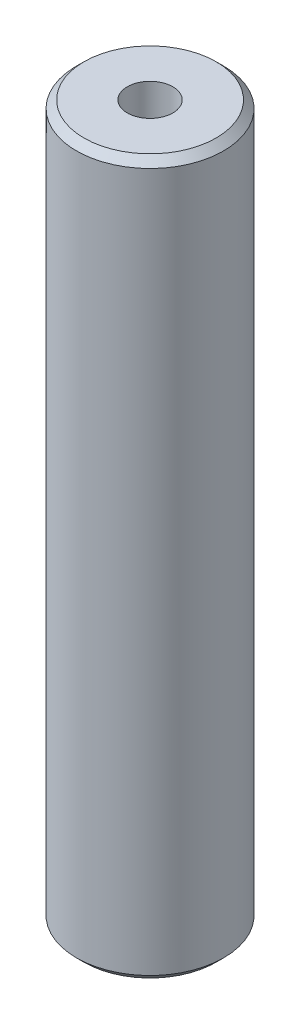
ISO-10303-21;
HEADER;
FILE_DESCRIPTION(('STEP AP214'),'2;1');
FILE_NAME('part.step','',(''),(''),'','','');
FILE_SCHEMA(('AUTOMOTIVE_DESIGN { 1 0 10303 214 1 1 1 1 }'));
ENDSEC;
DATA;
#1=APPLICATION_CONTEXT('core data for automotive mechanical design processes');
#2=APPLICATION_PROTOCOL_DEFINITION('international standard','automotive_design',2000,#1);
#3=PRODUCT_CONTEXT('',#1,'mechanical');
#4=PRODUCT('Part','Part','',(#3));
#5=PRODUCT_RELATED_PRODUCT_CATEGORY('part','',(#4));
#6=PRODUCT_DEFINITION_FORMATION('','',#4);
#7=PRODUCT_DEFINITION_CONTEXT('part definition',#1,'design');
#8=PRODUCT_DEFINITION('design','',#6,#7);
#9=PRODUCT_DEFINITION_SHAPE('','',#8);
#10=(LENGTH_UNIT() NAMED_UNIT(*) SI_UNIT(.MILLI.,.METRE.));
#11=(NAMED_UNIT(*) PLANE_ANGLE_UNIT() SI_UNIT($,.RADIAN.));
#12=(NAMED_UNIT(*) SI_UNIT($,.STERADIAN.) SOLID_ANGLE_UNIT());
#13=UNCERTAINTY_MEASURE_WITH_UNIT(LENGTH_MEASURE(1.E-05),#10,'distance_accuracy_value','');
#14=(GEOMETRIC_REPRESENTATION_CONTEXT(3) GLOBAL_UNCERTAINTY_ASSIGNED_CONTEXT((#13)) GLOBAL_UNIT_ASSIGNED_CONTEXT((#10,
#11,#12)) REPRESENTATION_CONTEXT('',''));
#15=CARTESIAN_POINT('',(0.,0.,0.));
#16=DIRECTION('',(0.,0.,1.));
#17=DIRECTION('',(1.,0.,0.));
#18=AXIS2_PLACEMENT_3D('',#15,#16,#17);
#19=CARTESIAN_POINT('',(0.,412.433679047202,0.));
#20=DIRECTION('',(0.,-1.,0.));
#21=DIRECTION('',(0.,0.,-1.));
#22=AXIS2_PLACEMENT_3D('',#19,#20,#21);
#23=CYLINDRICAL_SURFACE('',#22,42.5);
#24=CARTESIAN_POINT('',(0.,408.121310022054,0.));
#25=DIRECTION('',(0.,1.,0.));
#26=DIRECTION('',(0.,0.,1.));
#27=AXIS2_PLACEMENT_3D('',#24,#25,#26);
#28=CIRCLE('',#27,42.5);
#29=CARTESIAN_POINT('',(0.,408.121310022054,-42.5));
#30=VERTEX_POINT('',#29);
#31=EDGE_CURVE('E50',#30,#30,#28,.F.);
#32=CARTESIAN_POINT('',(0.,4.31236902514853,0.));
#33=DIRECTION('',(0.,1.,0.));
#34=DIRECTION('',(0.,0.,1.));
#35=AXIS2_PLACEMENT_3D('',#32,#33,#34);
#36=CIRCLE('',#35,42.5);
#37=CARTESIAN_POINT('',(0.,4.31236902514853,-42.5));
#38=VERTEX_POINT('',#37);
#39=EDGE_CURVE('E51',#38,#38,#36,.T.);
#40=CARTESIAN_POINT('',(0.,408.121310022054,-42.5));
#41=CARTESIAN_POINT('',(0.,403.914966886669,-42.5));
#42=CARTESIAN_POINT('',(0.,399.708623751285,-42.5));
#43=CARTESIAN_POINT('',(0.,391.295937480516,-42.5));
#44=CARTESIAN_POINT('',(0.,387.089594345132,-42.5));
#45=CARTESIAN_POINT('',(0.,378.676908074363,-42.5));
#46=CARTESIAN_POINT('',(0.,374.470564938978,-42.5));
#47=CARTESIAN_POINT('',(0.,366.057878668209,-42.5));
#48=CARTESIAN_POINT('',(0.,361.851535532825,-42.5));
#49=CARTESIAN_POINT('',(0.,353.438849262056,-42.5));
#50=CARTESIAN_POINT('',(0.,349.232506126672,-42.5));
#51=CARTESIAN_POINT('',(0.,340.819819855903,-42.5));
#52=CARTESIAN_POINT('',(0.,336.613476720518,-42.5));
#53=CARTESIAN_POINT('',(0.,328.20079044975,-42.5));
#54=CARTESIAN_POINT('',(0.,323.994447314365,-42.5));
#55=CARTESIAN_POINT('',(0.,315.581761043596,-42.5));
#56=CARTESIAN_POINT('',(0.,311.375417908212,-42.5));
#57=CARTESIAN_POINT('',(0.,302.962731637443,-42.5));
#58=CARTESIAN_POINT('',(0.,298.756388502059,-42.5));
#59=CARTESIAN_POINT('',(0.,290.34370223129,-42.5));
#60=CARTESIAN_POINT('',(0.,286.137359095905,-42.5));
#61=CARTESIAN_POINT('',(0.,277.724672825136,-42.5));
#62=CARTESIAN_POINT('',(0.,273.518329689752,-42.5));
#63=CARTESIAN_POINT('',(0.,265.105643418983,-42.5));
#64=CARTESIAN_POINT('',(0.,260.899300283599,-42.5));
#65=CARTESIAN_POINT('',(0.,252.48661401283,-42.5));
#66=CARTESIAN_POINT('',(0.,248.280270877445,-42.5));
#67=CARTESIAN_POINT('',(0.,239.867584606677,-42.5));
#68=CARTESIAN_POINT('',(0.,235.661241471292,-42.5));
#69=CARTESIAN_POINT('',(0.,227.248555200523,-42.5));
#70=CARTESIAN_POINT('',(0.,223.042212065139,-42.5));
#71=CARTESIAN_POINT('',(0.,214.62952579437,-42.5));
#72=CARTESIAN_POINT('',(0.,210.423182658986,-42.5));
#73=CARTESIAN_POINT('',(0.,202.010496388217,-42.5));
#74=CARTESIAN_POINT('',(0.,197.804153252832,-42.5));
#75=CARTESIAN_POINT('',(0.,189.391466982063,-42.5));
#76=CARTESIAN_POINT('',(0.,185.185123846679,-42.5));
#77=CARTESIAN_POINT('',(0.,176.77243757591,-42.5));
#78=CARTESIAN_POINT('',(0.,172.566094440526,-42.5));
#79=CARTESIAN_POINT('',(0.,164.153408169757,-42.5));
#80=CARTESIAN_POINT('',(0.,159.947065034372,-42.5));
#81=CARTESIAN_POINT('',(0.,151.534378763604,-42.5));
#82=CARTESIAN_POINT('',(0.,147.328035628219,-42.5));
#83=CARTESIAN_POINT('',(0.,138.91534935745,-42.5));
#84=CARTESIAN_POINT('',(0.,134.709006222066,-42.5));
#85=CARTESIAN_POINT('',(0.,126.296319951297,-42.5));
#86=CARTESIAN_POINT('',(0.,122.089976815913,-42.5));
#87=CARTESIAN_POINT('',(0.,113.677290545144,-42.5));
#88=CARTESIAN_POINT('',(0.,109.470947409759,-42.5));
#89=CARTESIAN_POINT('',(0.,101.05826113899,-42.5));
#90=CARTESIAN_POINT('',(0.,96.851918003606,-42.5));
#91=CARTESIAN_POINT('',(0.,88.4392317328371,-42.5));
#92=CARTESIAN_POINT('',(0.,84.2328885974527,-42.5));
#93=CARTESIAN_POINT('',(0.,75.8202023266839,-42.5));
#94=CARTESIAN_POINT('',(0.,71.6138591912994,-42.5));
#95=CARTESIAN_POINT('',(0.,63.2011729205306,-42.5));
#96=CARTESIAN_POINT('',(0.,58.9948297851461,-42.5));
#97=CARTESIAN_POINT('',(0.,50.5821435143772,-42.5));
#98=CARTESIAN_POINT('',(0.,46.3758003789928,-42.5));
#99=CARTESIAN_POINT('',(0.,37.9631141082239,-42.5));
#100=CARTESIAN_POINT('',(0.,33.7567709728395,-42.5));
#101=CARTESIAN_POINT('',(0.,25.3440847020707,-42.5));
#102=CARTESIAN_POINT('',(0.,21.1377415666862,-42.5));
#103=CARTESIAN_POINT('',(0.,12.7250552959174,-42.5));
#104=CARTESIAN_POINT('',(0.,8.51871216053296,-42.5));
#105=CARTESIAN_POINT('',(0.,4.31236902514853,-42.5));
#106=B_SPLINE_CURVE_WITH_KNOTS('',3,(#40,#41,#42,#43,#44,#45,#46,#47,#48,#49,#50,#51,#52,#53,
#54,#55,#56,#57,#58,#59,#60,#61,#62,#63,#64,#65,#66,#67,#68,#69,#70,#71,#72,#73,#74,#75,#76,#77,
#78,#79,#80,#81,#82,#83,#84,#85,#86,#87,#88,#89,#90,#91,#92,#93,#94,#95,#96,#97,#98,#99,#100,
#101,#102,#103,#104,#105),.UNSPECIFIED.,.F.,.F.,(4,2,2,2,2,2,2,2,2,2,2,2,2,2,2,2,2,2,2,2,2,2,2,
2,2,2,2,2,2,2,2,2,4),(0.,12.6190294061533,25.2380588123066,37.8570882184598,50.4761176246131,
63.0951470307664,75.7141764369197,88.333205843073,100.952235249226,113.57126465538,
126.190294061533,138.809323467686,151.428352873839,164.047382279993,176.666411686146,
189.285441092299,201.904470498453,214.523499904606,227.142529310759,239.761558716912,
252.380588123066,264.999617529219,277.618646935372,290.237676341526,302.856705747679,
315.475735153832,328.094764559985,340.713793966139,353.332823372292,365.951852778445,
378.570882184599,391.189911590752,403.808940996905),.UNSPECIFIED.);
#107=EDGE_CURVE('BSEAM39',#30,#38,#106,.T.);
#108=ORIENTED_EDGE('',*,*,#31,.T.);
#109=ORIENTED_EDGE('',*,*,#39,.T.);
#110=ORIENTED_EDGE('',*,*,#107,.T.);
#111=ORIENTED_EDGE('',*,*,#107,.F.);
#112=EDGE_LOOP('',(#108,#110,#109,#111));
#113=FACE_BOUND('',#112,.T.);
#114=ADVANCED_FACE('F39',(#113),#23,.T.);
#115=CARTESIAN_POINT('',(0.,412.433679047202,0.));
#116=DIRECTION('',(0.,1.,0.));
#117=DIRECTION('',(0.,0.,1.));
#118=AXIS2_PLACEMENT_3D('',#115,#116,#117);
#119=PLANE('',#118);
#120=CARTESIAN_POINT('',(0.,412.433679047202,0.));
#121=DIRECTION('',(0.,1.,0.));
#122=DIRECTION('',(0.,0.,1.));
#123=AXIS2_PLACEMENT_3D('',#120,#121,#122);
#124=CIRCLE('',#123,38.1876309748521);
#125=CARTESIAN_POINT('',(0.,412.433679047202,38.1876309748521));
#126=VERTEX_POINT('',#125);
#127=EDGE_CURVE('E54',#126,#126,#124,.T.);
#128=ORIENTED_EDGE('',*,*,#127,.T.);
#129=EDGE_LOOP('',(#128));
#130=FACE_BOUND('',#129,.T.);
#131=CARTESIAN_POINT('',(0.,412.433679047202,0.));
#132=DIRECTION('',(0.,1.,0.));
#133=DIRECTION('',(0.,0.,1.));
#134=AXIS2_PLACEMENT_3D('',#131,#132,#133);
#135=CIRCLE('',#134,13.1412385175297);
#136=CARTESIAN_POINT('',(0.,412.433679047202,-13.1412385175297));
#137=VERTEX_POINT('',#136);
#138=EDGE_CURVE('E58',#137,#137,#135,.T.);
#139=ORIENTED_EDGE('',*,*,#138,.F.);
#140=EDGE_LOOP('',(#139));
#141=FACE_BOUND('',#140,.T.);
#142=ADVANCED_FACE('F69',(#130,#141),#119,.T.);
#143=CARTESIAN_POINT('',(0.,0.,0.));
#144=DIRECTION('',(0.,1.,0.));
#145=DIRECTION('',(0.,0.,1.));
#146=AXIS2_PLACEMENT_3D('',#143,#144,#145);
#147=PLANE('',#146);
#148=CARTESIAN_POINT('',(0.,0.,0.));
#149=DIRECTION('',(0.,1.,0.));
#150=DIRECTION('',(0.,0.,1.));
#151=AXIS2_PLACEMENT_3D('',#148,#149,#150);
#152=CIRCLE('',#151,38.1876309748514);
#153=CARTESIAN_POINT('',(0.,0.,38.1876309748514));
#154=VERTEX_POINT('',#153);
#155=EDGE_CURVE('E10',#154,#154,#152,.F.);
#156=ORIENTED_EDGE('',*,*,#155,.T.);
#157=EDGE_LOOP('',(#156));
#158=FACE_BOUND('',#157,.T.);
#159=CARTESIAN_POINT('',(0.,0.,0.));
#160=DIRECTION('',(0.,1.,0.));
#161=DIRECTION('',(0.,0.,1.));
#162=AXIS2_PLACEMENT_3D('',#159,#160,#161);
#163=CIRCLE('',#162,13.1412385175297);
#164=CARTESIAN_POINT('',(0.,0.,-13.1412385175297));
#165=VERTEX_POINT('',#164);
#166=EDGE_CURVE('E63',#165,#165,#163,.T.);
#167=ORIENTED_EDGE('',*,*,#166,.T.);
#168=EDGE_LOOP('',(#167));
#169=FACE_BOUND('',#168,.T.);
#170=ADVANCED_FACE('F75',(#158,#169),#147,.F.);
#171=CARTESIAN_POINT('',(0.,412.433679047202,0.));
#172=DIRECTION('',(0.,-1.,0.));
#173=DIRECTION('',(0.,0.,-1.));
#174=AXIS2_PLACEMENT_3D('',#171,#172,#173);
#175=CYLINDRICAL_SURFACE('',#174,13.1412385175297);
#176=CARTESIAN_POINT('',(0.,412.433679047202,-13.1412385175297));
#177=CARTESIAN_POINT('',(0.,408.13749489046,-13.1412385175297));
#178=CARTESIAN_POINT('',(0.,403.841310733718,-13.1412385175297));
#179=CARTESIAN_POINT('',(0.,395.248942420235,-13.1412385175297));
#180=CARTESIAN_POINT('',(0.,390.952758263493,-13.1412385175297));
#181=CARTESIAN_POINT('',(0.,382.36038995001,-13.1412385175297));
#182=CARTESIAN_POINT('',(0.,378.064205793268,-13.1412385175297));
#183=CARTESIAN_POINT('',(0.,369.471837479785,-13.1412385175297));
#184=CARTESIAN_POINT('',(0.,365.175653323043,-13.1412385175297));
#185=CARTESIAN_POINT('',(0.,356.58328500956,-13.1412385175297));
#186=CARTESIAN_POINT('',(0.,352.287100852818,-13.1412385175297));
#187=CARTESIAN_POINT('',(0.,343.694732539335,-13.1412385175297));
#188=CARTESIAN_POINT('',(0.,339.398548382593,-13.1412385175297));
#189=CARTESIAN_POINT('',(0.,330.80618006911,-13.1412385175297));
#190=CARTESIAN_POINT('',(0.,326.509995912368,-13.1412385175297));
#191=CARTESIAN_POINT('',(0.,317.917627598885,-13.1412385175297));
#192=CARTESIAN_POINT('',(0.,313.621443442143,-13.1412385175297));
#193=CARTESIAN_POINT('',(0.,305.02907512866,-13.1412385175297));
#194=CARTESIAN_POINT('',(0.,300.732890971918,-13.1412385175297));
#195=CARTESIAN_POINT('',(0.,292.140522658435,-13.1412385175297));
#196=CARTESIAN_POINT('',(0.,287.844338501693,-13.1412385175297));
#197=CARTESIAN_POINT('',(0.,279.251970188209,-13.1412385175297));
#198=CARTESIAN_POINT('',(0.,274.955786031468,-13.1412385175297));
#199=CARTESIAN_POINT('',(0.,266.363417717984,-13.1412385175297));
#200=CARTESIAN_POINT('',(0.,262.067233561243,-13.1412385175297));
#201=CARTESIAN_POINT('',(0.,253.474865247759,-13.1412385175297));
#202=CARTESIAN_POINT('',(0.,249.178681091018,-13.1412385175297));
#203=CARTESIAN_POINT('',(0.,240.586312777534,-13.1412385175297));
#204=CARTESIAN_POINT('',(0.,236.290128620793,-13.1412385175297));
#205=CARTESIAN_POINT('',(0.,227.697760307309,-13.1412385175297));
#206=CARTESIAN_POINT('',(0.,223.401576150568,-13.1412385175297));
#207=CARTESIAN_POINT('',(0.,214.809207837084,-13.1412385175297));
#208=CARTESIAN_POINT('',(0.,210.513023680343,-13.1412385175297));
#209=CARTESIAN_POINT('',(0.,201.920655366859,-13.1412385175297));
#210=CARTESIAN_POINT('',(0.,197.624471210117,-13.1412385175297));
#211=CARTESIAN_POINT('',(0.,189.032102896634,-13.1412385175297));
#212=CARTESIAN_POINT('',(0.,184.735918739892,-13.1412385175297));
#213=CARTESIAN_POINT('',(0.,176.143550426409,-13.1412385175297));
#214=CARTESIAN_POINT('',(0.,171.847366269667,-13.1412385175297));
#215=CARTESIAN_POINT('',(0.,163.254997956184,-13.1412385175297));
#216=CARTESIAN_POINT('',(0.,158.958813799442,-13.1412385175297));
#217=CARTESIAN_POINT('',(0.,150.366445485959,-13.1412385175297));
#218=CARTESIAN_POINT('',(0.,146.070261329217,-13.1412385175297));
#219=CARTESIAN_POINT('',(0.,137.477893015734,-13.1412385175297));
#220=CARTESIAN_POINT('',(0.,133.181708858992,-13.1412385175297));
#221=CARTESIAN_POINT('',(0.,124.589340545509,-13.1412385175297));
#222=CARTESIAN_POINT('',(0.,120.293156388767,-13.1412385175297));
#223=CARTESIAN_POINT('',(0.,111.700788075284,-13.1412385175297));
#224=CARTESIAN_POINT('',(0.,107.404603918542,-13.1412385175297));
#225=CARTESIAN_POINT('',(0.,98.8122356050588,-13.1412385175297));
#226=CARTESIAN_POINT('',(0.,94.5160514483171,-13.1412385175297));
#227=CARTESIAN_POINT('',(0.,85.9236831348337,-13.1412385175297));
#228=CARTESIAN_POINT('',(0.,81.627498978092,-13.1412385175297));
#229=CARTESIAN_POINT('',(0.,73.0351306646087,-13.1412385175297));
#230=CARTESIAN_POINT('',(0.,68.738946507867,-13.1412385175297));
#231=CARTESIAN_POINT('',(0.,60.1465781943836,-13.1412385175297));
#232=CARTESIAN_POINT('',(0.,55.8503940376419,-13.1412385175297));
#233=CARTESIAN_POINT('',(0.,47.2580257241585,-13.1412385175297));
#234=CARTESIAN_POINT('',(0.,42.9618415674168,-13.1412385175297));
#235=CARTESIAN_POINT('',(0.,34.3694732539335,-13.1412385175297));
#236=CARTESIAN_POINT('',(0.,30.0732890971918,-13.1412385175297));
#237=CARTESIAN_POINT('',(0.,21.4809207837084,-13.1412385175297));
#238=CARTESIAN_POINT('',(0.,17.1847366269668,-13.1412385175297));
#239=CARTESIAN_POINT('',(0.,8.59236831348339,-13.1412385175297));
#240=CARTESIAN_POINT('',(0.,4.2961841567417,-13.1412385175297));
#241=CARTESIAN_POINT('',(0.,0.,-13.1412385175297));
#242=B_SPLINE_CURVE_WITH_KNOTS('',3,(#176,#177,#178,#179,#180,#181,#182,#183,#184,#185,#186,
#187,#188,#189,#190,#191,#192,#193,#194,#195,#196,#197,#198,#199,#200,#201,#202,#203,#204,#205,
#206,#207,#208,#209,#210,#211,#212,#213,#214,#215,#216,#217,#218,#219,#220,#221,#222,#223,#224,
#225,#226,#227,#228,#229,#230,#231,#232,#233,#234,#235,#236,#237,#238,#239,#240,#241),
.UNSPECIFIED.,.F.,.F.,(4,2,2,2,2,2,2,2,2,2,2,2,2,2,2,2,2,2,2,2,2,2,2,2,2,2,2,2,2,2,2,2,4),(0.,
12.8885524702251,25.7771049404502,38.6656574106752,51.5542098809003,64.4427623511253,
77.3313148213504,90.2198672915754,103.1084197618,115.996972232026,128.885524702251,
141.774077172476,154.662629642701,167.551182112926,180.439734583151,193.328287053376,
206.216839523601,219.105391993826,231.993944464051,244.882496934276,257.771049404501,
270.659601874726,283.548154344951,296.436706815176,309.325259285401,322.213811755626,
335.102364225851,347.990916696077,360.879469166302,373.768021636527,386.656574106752,
399.545126576977,412.433679047202),.UNSPECIFIED.);
#243=EDGE_CURVE('BSEAM70',#137,#165,#242,.T.);
#244=ORIENTED_EDGE('',*,*,#138,.T.);
#245=ORIENTED_EDGE('',*,*,#166,.F.);
#246=ORIENTED_EDGE('',*,*,#243,.T.);
#247=ORIENTED_EDGE('',*,*,#243,.F.);
#248=EDGE_LOOP('',(#244,#246,#245,#247));
#249=FACE_BOUND('',#248,.T.);
#250=ADVANCED_FACE('F70',(#249),#175,.F.);
#251=CARTESIAN_POINT('',(0.,412.433679047202,0.));
#252=DIRECTION('',(0.,-1.,0.));
#253=DIRECTION('',(0.,0.,-1.));
#254=AXIS2_PLACEMENT_3D('',#251,#252,#253);
#255=CONICAL_SURFACE('',#254,38.1876309748521,0.785398163397439);
#256=ORIENTED_EDGE('',*,*,#31,.F.);
#257=EDGE_LOOP('',(#256));
#258=FACE_BOUND('',#257,.T.);
#259=ORIENTED_EDGE('',*,*,#127,.F.);
#260=EDGE_LOOP('',(#259));
#261=FACE_BOUND('',#260,.T.);
#262=ADVANCED_FACE('F81',(#258,#261),#255,.T.);
#263=CARTESIAN_POINT('',(0.,4.31236902514853,0.));
#264=DIRECTION('',(0.,1.,0.));
#265=DIRECTION('',(0.,0.,1.));
#266=AXIS2_PLACEMENT_3D('',#263,#264,#265);
#267=CONICAL_SURFACE('',#266,42.5,0.785398163397452);
#268=ORIENTED_EDGE('',*,*,#155,.F.);
#269=EDGE_LOOP('',(#268));
#270=FACE_BOUND('',#269,.T.);
#271=ORIENTED_EDGE('',*,*,#39,.F.);
#272=EDGE_LOOP('',(#271));
#273=FACE_BOUND('',#272,.T.);
#274=ADVANCED_FACE('F45',(#270,#273),#267,.T.);
#275=CLOSED_SHELL('',(#114,#142,#170,#250,#262,#274));
#276=MANIFOLD_SOLID_BREP('B2',#275);
#277=ADVANCED_BREP_SHAPE_REPRESENTATION('',(#18,#276),#14);
#278=SHAPE_DEFINITION_REPRESENTATION(#9,#277);
ENDSEC;
END-ISO-10303-21;
